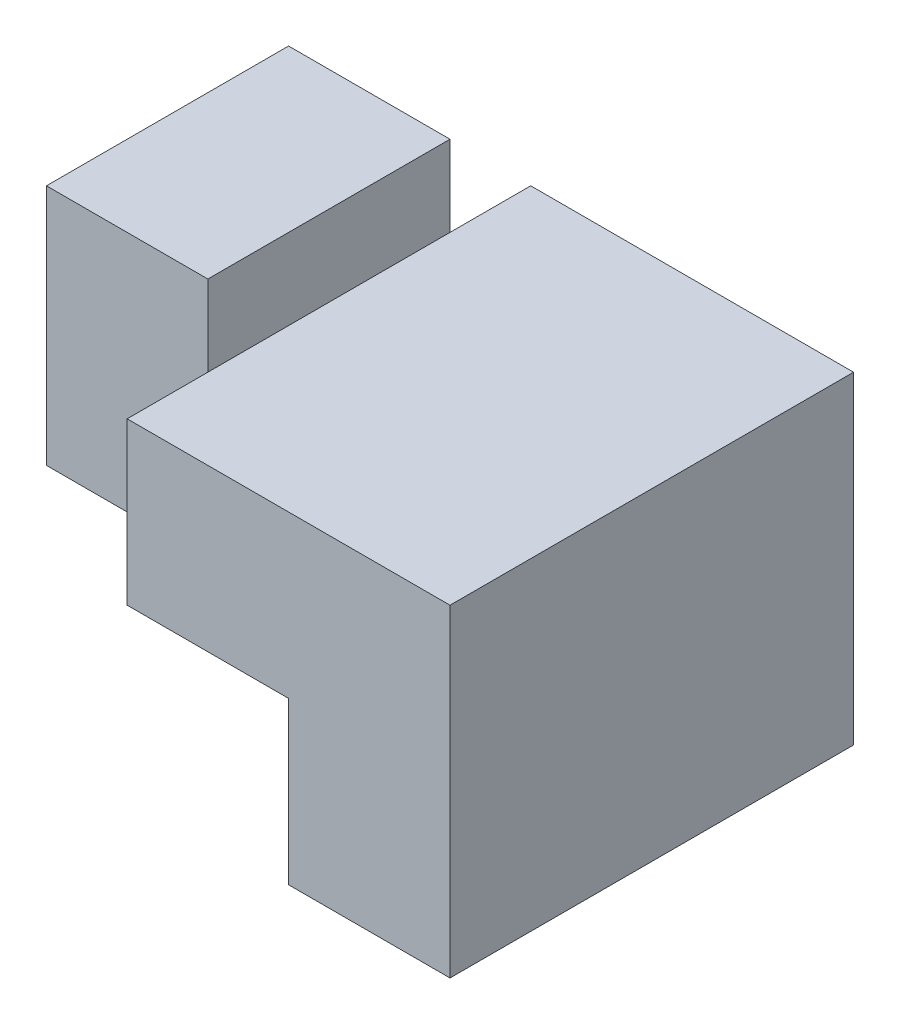
ISO-10303-21;
HEADER;
FILE_DESCRIPTION(('STEP AP214'),'2;1');
FILE_NAME('part.step','',(''),(''),'','','');
FILE_SCHEMA(('AUTOMOTIVE_DESIGN { 1 0 10303 214 1 1 1 1 }'));
ENDSEC;
DATA;
#1=APPLICATION_CONTEXT('core data for automotive mechanical design processes');
#2=APPLICATION_PROTOCOL_DEFINITION('international standard','automotive_design',2000,#1);
#3=PRODUCT_CONTEXT('',#1,'mechanical');
#4=PRODUCT('Part','Part','',(#3));
#5=PRODUCT_RELATED_PRODUCT_CATEGORY('part','',(#4));
#6=PRODUCT_DEFINITION_FORMATION('','',#4);
#7=PRODUCT_DEFINITION_CONTEXT('part definition',#1,'design');
#8=PRODUCT_DEFINITION('design','',#6,#7);
#9=PRODUCT_DEFINITION_SHAPE('','',#8);
#10=(LENGTH_UNIT() NAMED_UNIT(*) SI_UNIT(.MILLI.,.METRE.));
#11=(NAMED_UNIT(*) PLANE_ANGLE_UNIT() SI_UNIT($,.RADIAN.));
#12=(NAMED_UNIT(*) SI_UNIT($,.STERADIAN.) SOLID_ANGLE_UNIT());
#13=UNCERTAINTY_MEASURE_WITH_UNIT(LENGTH_MEASURE(1.E-05),#10,'distance_accuracy_value','');
#14=(GEOMETRIC_REPRESENTATION_CONTEXT(3) GLOBAL_UNCERTAINTY_ASSIGNED_CONTEXT((#13)) GLOBAL_UNIT_ASSIGNED_CONTEXT((#10,
#11,#12)) REPRESENTATION_CONTEXT('',''));
#15=CARTESIAN_POINT('',(0.,0.,0.));
#16=DIRECTION('',(0.,0.,1.));
#17=DIRECTION('',(1.,0.,0.));
#18=AXIS2_PLACEMENT_3D('',#15,#16,#17);
#19=CARTESIAN_POINT('',(10.,0.,10.));
#20=DIRECTION('',(1.,0.,0.));
#21=DIRECTION('',(0.,0.,-1.));
#22=AXIS2_PLACEMENT_3D('',#19,#20,#21);
#23=PLANE('',#22);
#24=DIRECTION('',(0.,-1.,0.));
#25=VECTOR('',#24,1.);
#26=CARTESIAN_POINT('',(10.,0.,0.));
#27=LINE('',#26,#25);
#28=CARTESIAN_POINT('',(10.,20.,0.));
#29=VERTEX_POINT('',#28);
#30=CARTESIAN_POINT('',(10.,10.,0.));
#31=VERTEX_POINT('',#30);
#32=EDGE_CURVE('E272',#29,#31,#27,.T.);
#33=ORIENTED_EDGE('',*,*,#32,.T.);
#34=DIRECTION('',(0.,0.,-1.));
#35=VECTOR('',#34,1.);
#36=CARTESIAN_POINT('',(10.,10.,5.));
#37=LINE('',#36,#35);
#38=CARTESIAN_POINT('',(10.,10.,5.));
#39=VERTEX_POINT('',#38);
#40=EDGE_CURVE('E304',#39,#31,#37,.T.);
#41=ORIENTED_EDGE('',*,*,#40,.F.);
#42=DIRECTION('',(0.,1.,0.));
#43=VECTOR('',#42,1.);
#44=CARTESIAN_POINT('',(10.,0.,5.));
#45=LINE('',#44,#43);
#46=CARTESIAN_POINT('',(10.,20.,5.));
#47=VERTEX_POINT('',#46);
#48=EDGE_CURVE('E315',#39,#47,#45,.T.);
#49=ORIENTED_EDGE('',*,*,#48,.T.);
#50=DIRECTION('',(0.,0.,1.));
#51=VECTOR('',#50,1.);
#52=CARTESIAN_POINT('',(10.,20.,0.));
#53=LINE('',#52,#51);
#54=EDGE_CURVE('E252',#29,#47,#53,.T.);
#55=ORIENTED_EDGE('',*,*,#54,.F.);
#56=EDGE_LOOP('',(#33,#41,#49,#55));
#57=FACE_BOUND('',#56,.T.);
#58=ADVANCED_FACE('F33',(#57),#23,.F.);
#59=CARTESIAN_POINT('',(10.,0.,15.));
#60=DIRECTION('',(1.,0.,0.));
#61=DIRECTION('',(0.,0.,-1.));
#62=AXIS2_PLACEMENT_3D('',#59,#60,#61);
#63=PLANE('',#62);
#64=DIRECTION('',(0.,1.,0.));
#65=VECTOR('',#64,1.);
#66=CARTESIAN_POINT('',(10.,0.,20.));
#67=LINE('',#66,#65);
#68=CARTESIAN_POINT('',(10.,10.,20.));
#69=VERTEX_POINT('',#68);
#70=CARTESIAN_POINT('',(10.,20.,20.));
#71=VERTEX_POINT('',#70);
#72=EDGE_CURVE('E321',#69,#71,#67,.T.);
#73=ORIENTED_EDGE('',*,*,#72,.F.);
#74=DIRECTION('',(0.,0.,1.));
#75=VECTOR('',#74,1.);
#76=CARTESIAN_POINT('',(10.,10.,20.));
#77=LINE('',#76,#75);
#78=CARTESIAN_POINT('',(10.,10.,25.));
#79=VERTEX_POINT('',#78);
#80=EDGE_CURVE('E295',#69,#79,#77,.T.);
#81=ORIENTED_EDGE('',*,*,#80,.T.);
#82=DIRECTION('',(0.,1.,0.));
#83=VECTOR('',#82,1.);
#84=CARTESIAN_POINT('',(10.,0.,25.));
#85=LINE('',#84,#83);
#86=CARTESIAN_POINT('',(10.,20.,25.));
#87=VERTEX_POINT('',#86);
#88=EDGE_CURVE('E197',#79,#87,#85,.T.);
#89=ORIENTED_EDGE('',*,*,#88,.T.);
#90=EDGE_CURVE('E248',#71,#87,#53,.T.);
#91=ORIENTED_EDGE('',*,*,#90,.F.);
#92=EDGE_LOOP('',(#73,#81,#89,#91));
#93=FACE_BOUND('',#92,.T.);
#94=ADVANCED_FACE('F387',(#93),#63,.F.);
#95=CARTESIAN_POINT('',(0.,0.,25.));
#96=DIRECTION('',(0.,1.,0.));
#97=DIRECTION('',(0.,0.,1.));
#98=AXIS2_PLACEMENT_3D('',#95,#96,#97);
#99=PLANE('',#98);
#100=DIRECTION('',(0.,0.,-1.));
#101=VECTOR('',#100,1.);
#102=CARTESIAN_POINT('',(0.,0.,25.));
#103=LINE('',#102,#101);
#104=CARTESIAN_POINT('',(0.,0.,15.));
#105=VERTEX_POINT('',#104);
#106=CARTESIAN_POINT('',(0.,0.,10.));
#107=VERTEX_POINT('',#106);
#108=EDGE_CURVE('E230',#105,#107,#103,.T.);
#109=ORIENTED_EDGE('',*,*,#108,.T.);
#110=DIRECTION('',(-1.,0.,0.));
#111=VECTOR('',#110,1.);
#112=CARTESIAN_POINT('',(10.,0.,10.));
#113=LINE('',#112,#111);
#114=CARTESIAN_POINT('',(10.,0.,10.));
#115=VERTEX_POINT('',#114);
#116=EDGE_CURVE('E263',#115,#107,#113,.T.);
#117=ORIENTED_EDGE('',*,*,#116,.F.);
#118=DIRECTION('',(0.,0.,1.));
#119=VECTOR('',#118,1.);
#120=CARTESIAN_POINT('',(10.,0.,0.));
#121=LINE('',#120,#119);
#122=CARTESIAN_POINT('',(10.,0.,15.));
#123=VERTEX_POINT('',#122);
#124=EDGE_CURVE('E188',#115,#123,#121,.T.);
#125=ORIENTED_EDGE('',*,*,#124,.T.);
#126=DIRECTION('',(1.,0.,0.));
#127=VECTOR('',#126,1.);
#128=CARTESIAN_POINT('',(0.,0.,15.));
#129=LINE('',#128,#127);
#130=EDGE_CURVE('E196',#105,#123,#129,.T.);
#131=ORIENTED_EDGE('',*,*,#130,.F.);
#132=EDGE_LOOP('',(#109,#117,#125,#131));
#133=FACE_BOUND('',#132,.T.);
#134=ADVANCED_FACE('F409',(#133),#99,.F.);
#135=CARTESIAN_POINT('',(0.,0.,25.));
#136=DIRECTION('',(1.,0.,0.));
#137=DIRECTION('',(0.,0.,-1.));
#138=AXIS2_PLACEMENT_3D('',#135,#136,#137);
#139=PLANE('',#138);
#140=DIRECTION('',(0.,0.,-1.));
#141=VECTOR('',#140,1.);
#142=CARTESIAN_POINT('',(0.,25.,25.));
#143=LINE('',#142,#141);
#144=CARTESIAN_POINT('',(0.,25.,20.));
#145=VERTEX_POINT('',#144);
#146=CARTESIAN_POINT('',(0.,25.,5.));
#147=VERTEX_POINT('',#146);
#148=EDGE_CURVE('E221',#145,#147,#143,.T.);
#149=ORIENTED_EDGE('',*,*,#148,.T.);
#150=DIRECTION('',(0.,1.,0.));
#151=VECTOR('',#150,1.);
#152=CARTESIAN_POINT('',(0.,0.,5.));
#153=LINE('',#152,#151);
#154=CARTESIAN_POINT('',(0.,10.,5.));
#155=VERTEX_POINT('',#154);
#156=EDGE_CURVE('E313',#155,#147,#153,.T.);
#157=ORIENTED_EDGE('',*,*,#156,.F.);
#158=DIRECTION('',(0.,0.,-1.));
#159=VECTOR('',#158,1.);
#160=CARTESIAN_POINT('',(0.,10.,10.));
#161=LINE('',#160,#159);
#162=CARTESIAN_POINT('',(0.,10.,10.));
#163=VERTEX_POINT('',#162);
#164=EDGE_CURVE('E271',#163,#155,#161,.T.);
#165=ORIENTED_EDGE('',*,*,#164,.F.);
#166=DIRECTION('',(0.,1.,0.));
#167=VECTOR('',#166,1.);
#168=CARTESIAN_POINT('',(0.,0.,10.));
#169=LINE('',#168,#167);
#170=EDGE_CURVE('E266',#107,#163,#169,.T.);
#171=ORIENTED_EDGE('',*,*,#170,.F.);
#172=ORIENTED_EDGE('',*,*,#108,.F.);
#173=DIRECTION('',(0.,-1.,0.));
#174=VECTOR('',#173,1.);
#175=CARTESIAN_POINT('',(0.,0.,15.));
#176=LINE('',#175,#174);
#177=CARTESIAN_POINT('',(0.,10.,15.));
#178=VERTEX_POINT('',#177);
#179=EDGE_CURVE('E194',#178,#105,#176,.T.);
#180=ORIENTED_EDGE('',*,*,#179,.F.);
#181=DIRECTION('',(0.,0.,1.));
#182=VECTOR('',#181,1.);
#183=CARTESIAN_POINT('',(0.,10.,15.));
#184=LINE('',#183,#182);
#185=CARTESIAN_POINT('',(0.,10.,20.));
#186=VERTEX_POINT('',#185);
#187=EDGE_CURVE('E209',#178,#186,#184,.T.);
#188=ORIENTED_EDGE('',*,*,#187,.T.);
#189=DIRECTION('',(0.,1.,0.));
#190=VECTOR('',#189,1.);
#191=CARTESIAN_POINT('',(0.,0.,20.));
#192=LINE('',#191,#190);
#193=EDGE_CURVE('E314',#186,#145,#192,.T.);
#194=ORIENTED_EDGE('',*,*,#193,.T.);
#195=EDGE_LOOP('',(#149,#157,#165,#171,#172,#180,#188,#194));
#196=FACE_BOUND('',#195,.T.);
#197=ADVANCED_FACE('F35',(#196),#139,.F.);
#198=DIRECTION('',(1.,0.,0.));
#199=VECTOR('',#198,1.);
#200=CARTESIAN_POINT('',(0.,0.,25.));
#201=LINE('',#200,#199);
#202=CARTESIAN_POINT('',(20.,0.,25.));
#203=VERTEX_POINT('',#202);
#204=CARTESIAN_POINT('',(30.,0.,25.));
#205=VERTEX_POINT('',#204);
#206=EDGE_CURVE('E215',#203,#205,#201,.T.);
#207=ORIENTED_EDGE('',*,*,#206,.F.);
#208=DIRECTION('',(0.,0.,1.));
#209=VECTOR('',#208,1.);
#210=CARTESIAN_POINT('',(20.,0.,0.));
#211=LINE('',#210,#209);
#212=CARTESIAN_POINT('',(20.,0.,0.));
#213=VERTEX_POINT('',#212);
#214=EDGE_CURVE('E183',#213,#203,#211,.T.);
#215=ORIENTED_EDGE('',*,*,#214,.F.);
#216=DIRECTION('',(1.,0.,0.));
#217=VECTOR('',#216,1.);
#218=CARTESIAN_POINT('',(0.,0.,0.));
#219=LINE('',#218,#217);
#220=CARTESIAN_POINT('',(30.,0.,0.));
#221=VERTEX_POINT('',#220);
#222=EDGE_CURVE('E212',#213,#221,#219,.T.);
#223=ORIENTED_EDGE('',*,*,#222,.T.);
#224=DIRECTION('',(0.,0.,-1.));
#225=VECTOR('',#224,1.);
#226=CARTESIAN_POINT('',(30.,0.,25.));
#227=LINE('',#226,#225);
#228=EDGE_CURVE('E227',#205,#221,#227,.T.);
#229=ORIENTED_EDGE('',*,*,#228,.F.);
#230=EDGE_LOOP('',(#207,#215,#223,#229));
#231=FACE_BOUND('',#230,.T.);
#232=ADVANCED_FACE('F339',(#231),#99,.F.);
#233=CARTESIAN_POINT('',(30.,0.,25.));
#234=DIRECTION('',(-1.,0.,0.));
#235=DIRECTION('',(0.,0.,1.));
#236=AXIS2_PLACEMENT_3D('',#233,#234,#235);
#237=PLANE('',#236);
#238=DIRECTION('',(0.,1.,0.));
#239=VECTOR('',#238,1.);
#240=CARTESIAN_POINT('',(30.,0.,0.));
#241=LINE('',#240,#239);
#242=CARTESIAN_POINT('',(30.,20.,0.));
#243=VERTEX_POINT('',#242);
#244=EDGE_CURVE('E218',#221,#243,#241,.T.);
#245=ORIENTED_EDGE('',*,*,#244,.T.);
#246=DIRECTION('',(0.,0.,1.));
#247=VECTOR('',#246,1.);
#248=CARTESIAN_POINT('',(30.,20.,0.));
#249=LINE('',#248,#247);
#250=CARTESIAN_POINT('',(30.,20.,25.));
#251=VERTEX_POINT('',#250);
#252=EDGE_CURVE('E254',#243,#251,#249,.T.);
#253=ORIENTED_EDGE('',*,*,#252,.T.);
#254=DIRECTION('',(0.,1.,0.));
#255=VECTOR('',#254,1.);
#256=CARTESIAN_POINT('',(30.,0.,25.));
#257=LINE('',#256,#255);
#258=EDGE_CURVE('E217',#205,#251,#257,.T.);
#259=ORIENTED_EDGE('',*,*,#258,.F.);
#260=ORIENTED_EDGE('',*,*,#228,.T.);
#261=EDGE_LOOP('',(#245,#253,#259,#260));
#262=FACE_BOUND('',#261,.T.);
#263=ADVANCED_FACE('F335',(#262),#237,.F.);
#264=CARTESIAN_POINT('',(0.,25.,25.));
#265=DIRECTION('',(0.,-1.,0.));
#266=DIRECTION('',(0.,0.,-1.));
#267=AXIS2_PLACEMENT_3D('',#264,#265,#266);
#268=PLANE('',#267);
#269=DIRECTION('',(0.,0.,1.));
#270=VECTOR('',#269,1.);
#271=CARTESIAN_POINT('',(10.,25.,0.));
#272=LINE('',#271,#270);
#273=CARTESIAN_POINT('',(10.,25.,5.));
#274=VERTEX_POINT('',#273);
#275=CARTESIAN_POINT('',(10.,25.,20.));
#276=VERTEX_POINT('',#275);
#277=EDGE_CURVE('E241',#274,#276,#272,.T.);
#278=ORIENTED_EDGE('',*,*,#277,.F.);
#279=DIRECTION('',(1.,0.,0.));
#280=VECTOR('',#279,1.);
#281=CARTESIAN_POINT('',(0.,25.,5.));
#282=LINE('',#281,#280);
#283=EDGE_CURVE('E311',#147,#274,#282,.T.);
#284=ORIENTED_EDGE('',*,*,#283,.F.);
#285=ORIENTED_EDGE('',*,*,#148,.F.);
#286=DIRECTION('',(-1.,0.,0.));
#287=VECTOR('',#286,1.);
#288=CARTESIAN_POINT('',(0.,25.,20.));
#289=LINE('',#288,#287);
#290=EDGE_CURVE('E309',#276,#145,#289,.T.);
#291=ORIENTED_EDGE('',*,*,#290,.F.);
#292=EDGE_LOOP('',(#278,#284,#285,#291));
#293=FACE_BOUND('',#292,.T.);
#294=ADVANCED_FACE('F367',(#293),#268,.F.);
#295=CARTESIAN_POINT('',(0.,0.,25.));
#296=DIRECTION('',(0.,0.,-1.));
#297=DIRECTION('',(-1.,0.,0.));
#298=AXIS2_PLACEMENT_3D('',#295,#296,#297);
#299=PLANE('',#298);
#300=ORIENTED_EDGE('',*,*,#88,.F.);
#301=DIRECTION('',(-1.,0.,0.));
#302=VECTOR('',#301,1.);
#303=CARTESIAN_POINT('',(10.,10.,25.));
#304=LINE('',#303,#302);
#305=CARTESIAN_POINT('',(20.,10.,25.));
#306=VERTEX_POINT('',#305);
#307=EDGE_CURVE('E291',#306,#79,#304,.T.);
#308=ORIENTED_EDGE('',*,*,#307,.F.);
#309=DIRECTION('',(0.,1.,0.));
#310=VECTOR('',#309,1.);
#311=CARTESIAN_POINT('',(20.,0.,25.));
#312=LINE('',#311,#310);
#313=EDGE_CURVE('E278',#203,#306,#312,.T.);
#314=ORIENTED_EDGE('',*,*,#313,.F.);
#315=ORIENTED_EDGE('',*,*,#206,.T.);
#316=ORIENTED_EDGE('',*,*,#258,.T.);
#317=DIRECTION('',(1.,0.,0.));
#318=VECTOR('',#317,1.);
#319=CARTESIAN_POINT('',(30.,20.,25.));
#320=LINE('',#319,#318);
#321=EDGE_CURVE('E330',#87,#251,#320,.T.);
#322=ORIENTED_EDGE('',*,*,#321,.F.);
#323=EDGE_LOOP('',(#300,#308,#314,#315,#316,#322));
#324=FACE_BOUND('',#323,.T.);
#325=ADVANCED_FACE('F298',(#324),#299,.F.);
#326=CARTESIAN_POINT('',(0.,0.,0.));
#327=DIRECTION('',(0.,0.,-1.));
#328=DIRECTION('',(-1.,0.,0.));
#329=AXIS2_PLACEMENT_3D('',#326,#327,#328);
#330=PLANE('',#329);
#331=DIRECTION('',(0.,1.,0.));
#332=VECTOR('',#331,1.);
#333=CARTESIAN_POINT('',(20.,0.,0.));
#334=LINE('',#333,#332);
#335=CARTESIAN_POINT('',(20.,10.,0.));
#336=VERTEX_POINT('',#335);
#337=EDGE_CURVE('E193',#213,#336,#334,.T.);
#338=ORIENTED_EDGE('',*,*,#337,.T.);
#339=DIRECTION('',(1.,0.,0.));
#340=VECTOR('',#339,1.);
#341=CARTESIAN_POINT('',(20.,10.,0.));
#342=LINE('',#341,#340);
#343=EDGE_CURVE('E170',#31,#336,#342,.T.);
#344=ORIENTED_EDGE('',*,*,#343,.F.);
#345=ORIENTED_EDGE('',*,*,#32,.F.);
#346=DIRECTION('',(1.,0.,0.));
#347=VECTOR('',#346,1.);
#348=CARTESIAN_POINT('',(30.,20.,0.));
#349=LINE('',#348,#347);
#350=EDGE_CURVE('E259',#29,#243,#349,.T.);
#351=ORIENTED_EDGE('',*,*,#350,.T.);
#352=ORIENTED_EDGE('',*,*,#244,.F.);
#353=ORIENTED_EDGE('',*,*,#222,.F.);
#354=EDGE_LOOP('',(#338,#344,#345,#351,#352,#353));
#355=FACE_BOUND('',#354,.T.);
#356=ADVANCED_FACE('F342',(#355),#330,.T.);
#357=CARTESIAN_POINT('',(0.,10.,15.));
#358=DIRECTION('',(0.,1.,0.));
#359=DIRECTION('',(0.,0.,1.));
#360=AXIS2_PLACEMENT_3D('',#357,#358,#359);
#361=PLANE('',#360);
#362=DIRECTION('',(0.,0.,1.));
#363=VECTOR('',#362,1.);
#364=CARTESIAN_POINT('',(10.,10.,15.));
#365=LINE('',#364,#363);
#366=CARTESIAN_POINT('',(10.,10.,15.));
#367=VERTEX_POINT('',#366);
#368=EDGE_CURVE('E207',#367,#69,#365,.T.);
#369=ORIENTED_EDGE('',*,*,#368,.T.);
#370=DIRECTION('',(-1.,0.,0.));
#371=VECTOR('',#370,1.);
#372=CARTESIAN_POINT('',(0.,10.,20.));
#373=LINE('',#372,#371);
#374=EDGE_CURVE('E318',#69,#186,#373,.T.);
#375=ORIENTED_EDGE('',*,*,#374,.T.);
#376=ORIENTED_EDGE('',*,*,#187,.F.);
#377=DIRECTION('',(-1.,0.,0.));
#378=VECTOR('',#377,1.);
#379=CARTESIAN_POINT('',(0.,10.,15.));
#380=LINE('',#379,#378);
#381=EDGE_CURVE('E204',#367,#178,#380,.T.);
#382=ORIENTED_EDGE('',*,*,#381,.F.);
#383=EDGE_LOOP('',(#369,#375,#376,#382));
#384=FACE_BOUND('',#383,.T.);
#385=ADVANCED_FACE('F373',(#384),#361,.F.);
#386=DIRECTION('',(0.,0.,1.));
#387=VECTOR('',#386,1.);
#388=CARTESIAN_POINT('',(10.,5.,0.));
#389=LINE('',#388,#387);
#390=CARTESIAN_POINT('',(10.,5.,15.));
#391=VERTEX_POINT('',#390);
#392=CARTESIAN_POINT('',(10.,5.,20.));
#393=VERTEX_POINT('',#392);
#394=EDGE_CURVE('E182',#391,#393,#389,.T.);
#395=ORIENTED_EDGE('',*,*,#394,.T.);
#396=DIRECTION('',(0.,-1.,0.));
#397=VECTOR('',#396,1.);
#398=CARTESIAN_POINT('',(10.,5.,20.));
#399=LINE('',#398,#397);
#400=EDGE_CURVE('E299',#69,#393,#399,.T.);
#401=ORIENTED_EDGE('',*,*,#400,.F.);
#402=ORIENTED_EDGE('',*,*,#368,.F.);
#403=DIRECTION('',(0.,1.,0.));
#404=VECTOR('',#403,1.);
#405=CARTESIAN_POINT('',(10.,0.,15.));
#406=LINE('',#405,#404);
#407=EDGE_CURVE('E200',#391,#367,#406,.T.);
#408=ORIENTED_EDGE('',*,*,#407,.F.);
#409=EDGE_LOOP('',(#395,#401,#402,#408));
#410=FACE_BOUND('',#409,.T.);
#411=ADVANCED_FACE('F382',(#410),#63,.F.);
#412=CARTESIAN_POINT('',(0.,0.,15.));
#413=DIRECTION('',(0.,0.,-1.));
#414=DIRECTION('',(-1.,0.,0.));
#415=AXIS2_PLACEMENT_3D('',#412,#413,#414);
#416=PLANE('',#415);
#417=ORIENTED_EDGE('',*,*,#179,.T.);
#418=ORIENTED_EDGE('',*,*,#130,.T.);
#419=EDGE_CURVE('E201',#123,#391,#406,.T.);
#420=ORIENTED_EDGE('',*,*,#419,.T.);
#421=ORIENTED_EDGE('',*,*,#407,.T.);
#422=ORIENTED_EDGE('',*,*,#381,.T.);
#423=EDGE_LOOP('',(#417,#418,#420,#421,#422));
#424=FACE_BOUND('',#423,.T.);
#425=ADVANCED_FACE('F375',(#424),#416,.F.);
#426=CARTESIAN_POINT('',(10.,0.,0.));
#427=DIRECTION('',(-1.,0.,0.));
#428=DIRECTION('',(0.,0.,1.));
#429=AXIS2_PLACEMENT_3D('',#426,#427,#428);
#430=PLANE('',#429);
#431=ORIENTED_EDGE('',*,*,#124,.F.);
#432=DIRECTION('',(0.,-1.,0.));
#433=VECTOR('',#432,1.);
#434=CARTESIAN_POINT('',(10.,0.,10.));
#435=LINE('',#434,#433);
#436=CARTESIAN_POINT('',(10.,5.,10.));
#437=VERTEX_POINT('',#436);
#438=EDGE_CURVE('E264',#437,#115,#435,.T.);
#439=ORIENTED_EDGE('',*,*,#438,.F.);
#440=EDGE_CURVE('E186',#437,#391,#389,.T.);
#441=ORIENTED_EDGE('',*,*,#440,.T.);
#442=ORIENTED_EDGE('',*,*,#419,.F.);
#443=EDGE_LOOP('',(#431,#439,#441,#442));
#444=FACE_BOUND('',#443,.T.);
#445=ADVANCED_FACE('F422',(#444),#430,.F.);
#446=CARTESIAN_POINT('',(10.,5.,0.));
#447=DIRECTION('',(0.,1.,0.));
#448=DIRECTION('',(0.,0.,1.));
#449=AXIS2_PLACEMENT_3D('',#446,#447,#448);
#450=PLANE('',#449);
#451=CARTESIAN_POINT('',(10.,5.,5.));
#452=VERTEX_POINT('',#451);
#453=EDGE_CURVE('E175',#452,#437,#389,.T.);
#454=ORIENTED_EDGE('',*,*,#453,.F.);
#455=DIRECTION('',(-1.,0.,0.));
#456=VECTOR('',#455,1.);
#457=CARTESIAN_POINT('',(20.,5.,5.));
#458=LINE('',#457,#456);
#459=CARTESIAN_POINT('',(20.,5.,5.));
#460=VERTEX_POINT('',#459);
#461=EDGE_CURVE('E48',#460,#452,#458,.T.);
#462=ORIENTED_EDGE('',*,*,#461,.F.);
#463=DIRECTION('',(0.,0.,1.));
#464=VECTOR('',#463,1.);
#465=CARTESIAN_POINT('',(20.,5.,0.));
#466=LINE('',#465,#464);
#467=CARTESIAN_POINT('',(20.,5.,20.));
#468=VERTEX_POINT('',#467);
#469=EDGE_CURVE('E55',#460,#468,#466,.T.);
#470=ORIENTED_EDGE('',*,*,#469,.T.);
#471=DIRECTION('',(1.,0.,0.));
#472=VECTOR('',#471,1.);
#473=CARTESIAN_POINT('',(10.,5.,20.));
#474=LINE('',#473,#472);
#475=EDGE_CURVE('E302',#393,#468,#474,.T.);
#476=ORIENTED_EDGE('',*,*,#475,.F.);
#477=ORIENTED_EDGE('',*,*,#394,.F.);
#478=ORIENTED_EDGE('',*,*,#440,.F.);
#479=EDGE_LOOP('',(#454,#462,#470,#476,#477,#478));
#480=FACE_BOUND('',#479,.T.);
#481=ADVANCED_FACE('F173',(#480),#450,.F.);
#482=CARTESIAN_POINT('',(20.,0.,0.));
#483=DIRECTION('',(1.,0.,0.));
#484=DIRECTION('',(0.,0.,-1.));
#485=AXIS2_PLACEMENT_3D('',#482,#483,#484);
#486=PLANE('',#485);
#487=ORIENTED_EDGE('',*,*,#313,.T.);
#488=DIRECTION('',(0.,0.,1.));
#489=VECTOR('',#488,1.);
#490=CARTESIAN_POINT('',(20.,10.,20.));
#491=LINE('',#490,#489);
#492=CARTESIAN_POINT('',(20.,10.,20.));
#493=VERTEX_POINT('',#492);
#494=EDGE_CURVE('E283',#493,#306,#491,.T.);
#495=ORIENTED_EDGE('',*,*,#494,.F.);
#496=DIRECTION('',(0.,1.,0.));
#497=VECTOR('',#496,1.);
#498=CARTESIAN_POINT('',(20.,5.,20.));
#499=LINE('',#498,#497);
#500=EDGE_CURVE('E181',#468,#493,#499,.T.);
#501=ORIENTED_EDGE('',*,*,#500,.F.);
#502=ORIENTED_EDGE('',*,*,#469,.F.);
#503=DIRECTION('',(0.,-1.,0.));
#504=VECTOR('',#503,1.);
#505=CARTESIAN_POINT('',(20.,5.,5.));
#506=LINE('',#505,#504);
#507=CARTESIAN_POINT('',(20.,10.,5.));
#508=VERTEX_POINT('',#507);
#509=EDGE_CURVE('E164',#508,#460,#506,.T.);
#510=ORIENTED_EDGE('',*,*,#509,.F.);
#511=DIRECTION('',(0.,0.,-1.));
#512=VECTOR('',#511,1.);
#513=CARTESIAN_POINT('',(20.,10.,5.));
#514=LINE('',#513,#512);
#515=EDGE_CURVE('E300',#508,#336,#514,.T.);
#516=ORIENTED_EDGE('',*,*,#515,.T.);
#517=ORIENTED_EDGE('',*,*,#337,.F.);
#518=ORIENTED_EDGE('',*,*,#214,.T.);
#519=EDGE_LOOP('',(#487,#495,#501,#502,#510,#516,#517,#518));
#520=FACE_BOUND('',#519,.T.);
#521=ADVANCED_FACE('F179',(#520),#486,.F.);
#522=DIRECTION('',(0.,0.,-1.));
#523=VECTOR('',#522,1.);
#524=CARTESIAN_POINT('',(10.,10.,10.));
#525=LINE('',#524,#523);
#526=CARTESIAN_POINT('',(10.,10.,10.));
#527=VERTEX_POINT('',#526);
#528=EDGE_CURVE('E275',#527,#39,#525,.T.);
#529=ORIENTED_EDGE('',*,*,#528,.T.);
#530=DIRECTION('',(0.,1.,0.));
#531=VECTOR('',#530,1.);
#532=CARTESIAN_POINT('',(10.,5.,5.));
#533=LINE('',#532,#531);
#534=EDGE_CURVE('E176',#452,#39,#533,.T.);
#535=ORIENTED_EDGE('',*,*,#534,.F.);
#536=ORIENTED_EDGE('',*,*,#453,.T.);
#537=EDGE_CURVE('E260',#527,#437,#435,.T.);
#538=ORIENTED_EDGE('',*,*,#537,.F.);
#539=EDGE_LOOP('',(#529,#535,#536,#538));
#540=FACE_BOUND('',#539,.T.);
#541=ADVANCED_FACE('F357',(#540),#23,.F.);
#542=CARTESIAN_POINT('',(10.,10.,10.));
#543=DIRECTION('',(0.,1.,0.));
#544=DIRECTION('',(0.,0.,1.));
#545=AXIS2_PLACEMENT_3D('',#542,#543,#544);
#546=PLANE('',#545);
#547=ORIENTED_EDGE('',*,*,#164,.T.);
#548=DIRECTION('',(1.,0.,0.));
#549=VECTOR('',#548,1.);
#550=CARTESIAN_POINT('',(10.,10.,5.));
#551=LINE('',#550,#549);
#552=EDGE_CURVE('E327',#155,#39,#551,.T.);
#553=ORIENTED_EDGE('',*,*,#552,.T.);
#554=ORIENTED_EDGE('',*,*,#528,.F.);
#555=DIRECTION('',(1.,0.,0.));
#556=VECTOR('',#555,1.);
#557=CARTESIAN_POINT('',(10.,10.,10.));
#558=LINE('',#557,#556);
#559=EDGE_CURVE('E268',#163,#527,#558,.T.);
#560=ORIENTED_EDGE('',*,*,#559,.F.);
#561=EDGE_LOOP('',(#547,#553,#554,#560));
#562=FACE_BOUND('',#561,.T.);
#563=ADVANCED_FACE('F352',(#562),#546,.F.);
#564=CARTESIAN_POINT('',(0.,0.,10.));
#565=DIRECTION('',(0.,0.,1.));
#566=DIRECTION('',(1.,0.,0.));
#567=AXIS2_PLACEMENT_3D('',#564,#565,#566);
#568=PLANE('',#567);
#569=ORIENTED_EDGE('',*,*,#537,.T.);
#570=ORIENTED_EDGE('',*,*,#438,.T.);
#571=ORIENTED_EDGE('',*,*,#116,.T.);
#572=ORIENTED_EDGE('',*,*,#170,.T.);
#573=ORIENTED_EDGE('',*,*,#559,.T.);
#574=EDGE_LOOP('',(#569,#570,#571,#572,#573));
#575=FACE_BOUND('',#574,.T.);
#576=ADVANCED_FACE('F360',(#575),#568,.F.);
#577=CARTESIAN_POINT('',(30.,20.,0.));
#578=DIRECTION('',(0.,-1.,0.));
#579=DIRECTION('',(1.,0.,0.));
#580=AXIS2_PLACEMENT_3D('',#577,#578,#579);
#581=PLANE('',#580);
#582=ORIENTED_EDGE('',*,*,#321,.T.);
#583=ORIENTED_EDGE('',*,*,#252,.F.);
#584=ORIENTED_EDGE('',*,*,#350,.F.);
#585=ORIENTED_EDGE('',*,*,#54,.T.);
#586=EDGE_CURVE('E238',#47,#71,#53,.T.);
#587=ORIENTED_EDGE('',*,*,#586,.T.);
#588=ORIENTED_EDGE('',*,*,#90,.T.);
#589=EDGE_LOOP('',(#582,#583,#584,#585,#587,#588));
#590=FACE_BOUND('',#589,.T.);
#591=ADVANCED_FACE('F246',(#590),#581,.F.);
#592=CARTESIAN_POINT('',(10.,25.,0.));
#593=DIRECTION('',(-1.,0.,0.));
#594=DIRECTION('',(0.,0.,1.));
#595=AXIS2_PLACEMENT_3D('',#592,#593,#594);
#596=PLANE('',#595);
#597=ORIENTED_EDGE('',*,*,#586,.F.);
#598=DIRECTION('',(0.,1.,0.));
#599=VECTOR('',#598,1.);
#600=CARTESIAN_POINT('',(10.,25.,5.));
#601=LINE('',#600,#599);
#602=EDGE_CURVE('E11',#47,#274,#601,.T.);
#603=ORIENTED_EDGE('',*,*,#602,.T.);
#604=ORIENTED_EDGE('',*,*,#277,.T.);
#605=DIRECTION('',(0.,-1.,0.));
#606=VECTOR('',#605,1.);
#607=CARTESIAN_POINT('',(10.,25.,20.));
#608=LINE('',#607,#606);
#609=EDGE_CURVE('E41',#276,#71,#608,.T.);
#610=ORIENTED_EDGE('',*,*,#609,.T.);
#611=EDGE_LOOP('',(#597,#603,#604,#610));
#612=FACE_BOUND('',#611,.T.);
#613=ADVANCED_FACE('F237',(#612),#596,.F.);
#614=CARTESIAN_POINT('',(0.,0.,20.));
#615=DIRECTION('',(0.,0.,-1.));
#616=DIRECTION('',(-1.,0.,0.));
#617=AXIS2_PLACEMENT_3D('',#614,#615,#616);
#618=PLANE('',#617);
#619=ORIENTED_EDGE('',*,*,#72,.T.);
#620=ORIENTED_EDGE('',*,*,#609,.F.);
#621=ORIENTED_EDGE('',*,*,#290,.T.);
#622=ORIENTED_EDGE('',*,*,#193,.F.);
#623=ORIENTED_EDGE('',*,*,#374,.F.);
#624=EDGE_LOOP('',(#619,#620,#621,#622,#623));
#625=FACE_BOUND('',#624,.T.);
#626=ADVANCED_FACE('F368',(#625),#618,.F.);
#627=CARTESIAN_POINT('',(0.,0.,5.));
#628=DIRECTION('',(0.,0.,1.));
#629=DIRECTION('',(1.,0.,0.));
#630=AXIS2_PLACEMENT_3D('',#627,#628,#629);
#631=PLANE('',#630);
#632=ORIENTED_EDGE('',*,*,#156,.T.);
#633=ORIENTED_EDGE('',*,*,#283,.T.);
#634=ORIENTED_EDGE('',*,*,#602,.F.);
#635=ORIENTED_EDGE('',*,*,#48,.F.);
#636=ORIENTED_EDGE('',*,*,#552,.F.);
#637=EDGE_LOOP('',(#632,#633,#634,#635,#636));
#638=FACE_BOUND('',#637,.T.);
#639=ADVANCED_FACE('F349',(#638),#631,.F.);
#640=CARTESIAN_POINT('',(10.,10.,20.));
#641=DIRECTION('',(0.,1.,0.));
#642=DIRECTION('',(0.,0.,1.));
#643=AXIS2_PLACEMENT_3D('',#640,#641,#642);
#644=PLANE('',#643);
#645=ORIENTED_EDGE('',*,*,#307,.T.);
#646=ORIENTED_EDGE('',*,*,#80,.F.);
#647=DIRECTION('',(-1.,0.,0.));
#648=VECTOR('',#647,1.);
#649=CARTESIAN_POINT('',(10.,10.,20.));
#650=LINE('',#649,#648);
#651=EDGE_CURVE('E294',#493,#69,#650,.T.);
#652=ORIENTED_EDGE('',*,*,#651,.F.);
#653=ORIENTED_EDGE('',*,*,#494,.T.);
#654=EDGE_LOOP('',(#645,#646,#652,#653));
#655=FACE_BOUND('',#654,.T.);
#656=ADVANCED_FACE('F290',(#655),#644,.F.);
#657=CARTESIAN_POINT('',(0.,0.,20.));
#658=DIRECTION('',(0.,0.,-1.));
#659=DIRECTION('',(-1.,0.,0.));
#660=AXIS2_PLACEMENT_3D('',#657,#658,#659);
#661=PLANE('',#660);
#662=ORIENTED_EDGE('',*,*,#400,.T.);
#663=ORIENTED_EDGE('',*,*,#475,.T.);
#664=ORIENTED_EDGE('',*,*,#500,.T.);
#665=ORIENTED_EDGE('',*,*,#651,.T.);
#666=EDGE_LOOP('',(#662,#663,#664,#665));
#667=FACE_BOUND('',#666,.T.);
#668=ADVANCED_FACE('F388',(#667),#661,.F.);
#669=CARTESIAN_POINT('',(20.,10.,5.));
#670=DIRECTION('',(0.,1.,0.));
#671=DIRECTION('',(0.,0.,1.));
#672=AXIS2_PLACEMENT_3D('',#669,#670,#671);
#673=PLANE('',#672);
#674=ORIENTED_EDGE('',*,*,#343,.T.);
#675=ORIENTED_EDGE('',*,*,#515,.F.);
#676=DIRECTION('',(1.,0.,0.));
#677=VECTOR('',#676,1.);
#678=CARTESIAN_POINT('',(20.,10.,5.));
#679=LINE('',#678,#677);
#680=EDGE_CURVE('E167',#39,#508,#679,.T.);
#681=ORIENTED_EDGE('',*,*,#680,.F.);
#682=ORIENTED_EDGE('',*,*,#40,.T.);
#683=EDGE_LOOP('',(#674,#675,#681,#682));
#684=FACE_BOUND('',#683,.T.);
#685=ADVANCED_FACE('F395',(#684),#673,.F.);
#686=CARTESIAN_POINT('',(0.,0.,5.));
#687=DIRECTION('',(0.,0.,1.));
#688=DIRECTION('',(1.,0.,0.));
#689=AXIS2_PLACEMENT_3D('',#686,#687,#688);
#690=PLANE('',#689);
#691=ORIENTED_EDGE('',*,*,#509,.T.);
#692=ORIENTED_EDGE('',*,*,#461,.T.);
#693=ORIENTED_EDGE('',*,*,#534,.T.);
#694=ORIENTED_EDGE('',*,*,#680,.T.);
#695=EDGE_LOOP('',(#691,#692,#693,#694));
#696=FACE_BOUND('',#695,.T.);
#697=ADVANCED_FACE('F165',(#696),#690,.F.);
#698=CLOSED_SHELL('',(#58,#94,#134,#197,#232,#263,#294,#325,#356,#385,#411,#425,#445,#481,#521,
#541,#563,#576,#591,#613,#626,#639,#656,#668,#685,#697));
#699=MANIFOLD_SOLID_BREP('B2',#698);
#700=ADVANCED_BREP_SHAPE_REPRESENTATION('',(#18,#699),#14);
#701=SHAPE_DEFINITION_REPRESENTATION(#9,#700);
ENDSEC;
END-ISO-10303-21;
